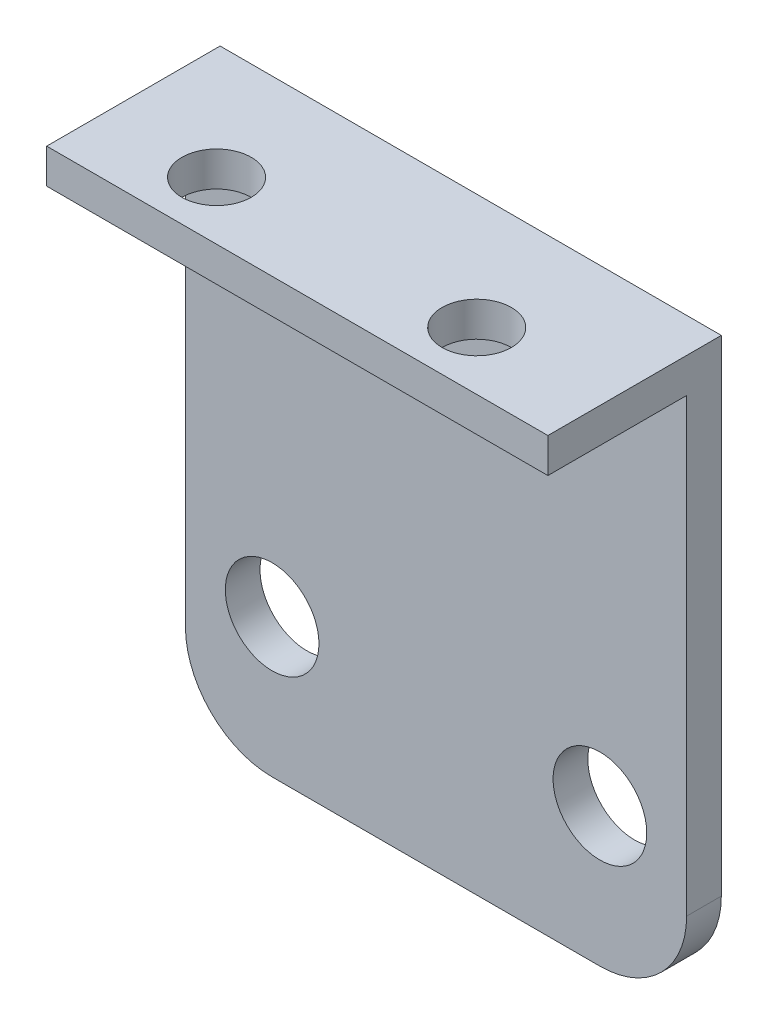
ISO-10303-21;
HEADER;
FILE_DESCRIPTION(('STEP AP214'),'2;1');
FILE_NAME('part.step','',(''),(''),'','','');
FILE_SCHEMA(('AUTOMOTIVE_DESIGN { 1 0 10303 214 1 1 1 1 }'));
ENDSEC;
DATA;
#1=APPLICATION_CONTEXT('core data for automotive mechanical design processes');
#2=APPLICATION_PROTOCOL_DEFINITION('international standard','automotive_design',2000,#1);
#3=PRODUCT_CONTEXT('',#1,'mechanical');
#4=PRODUCT('Part','Part','',(#3));
#5=PRODUCT_RELATED_PRODUCT_CATEGORY('part','',(#4));
#6=PRODUCT_DEFINITION_FORMATION('','',#4);
#7=PRODUCT_DEFINITION_CONTEXT('part definition',#1,'design');
#8=PRODUCT_DEFINITION('design','',#6,#7);
#9=PRODUCT_DEFINITION_SHAPE('','',#8);
#10=(LENGTH_UNIT() NAMED_UNIT(*) SI_UNIT(.MILLI.,.METRE.));
#11=(NAMED_UNIT(*) PLANE_ANGLE_UNIT() SI_UNIT($,.RADIAN.));
#12=(NAMED_UNIT(*) SI_UNIT($,.STERADIAN.) SOLID_ANGLE_UNIT());
#13=UNCERTAINTY_MEASURE_WITH_UNIT(LENGTH_MEASURE(1.E-05),#10,'distance_accuracy_value','');
#14=(GEOMETRIC_REPRESENTATION_CONTEXT(3) GLOBAL_UNCERTAINTY_ASSIGNED_CONTEXT((#13)) GLOBAL_UNIT_ASSIGNED_CONTEXT((#10,
#11,#12)) REPRESENTATION_CONTEXT('',''));
#15=CARTESIAN_POINT('',(0.,0.,0.));
#16=DIRECTION('',(0.,0.,1.));
#17=DIRECTION('',(1.,0.,0.));
#18=AXIS2_PLACEMENT_3D('',#15,#16,#17);
#19=CARTESIAN_POINT('',(0.,0.,2.));
#20=DIRECTION('',(0.,0.,-1.));
#21=DIRECTION('',(-1.,0.,0.));
#22=AXIS2_PLACEMENT_3D('',#19,#20,#21);
#23=PLANE('',#22);
#24=CARTESIAN_POINT('',(10.3547402338222,49.5925449565304,2.));
#25=DIRECTION('',(0.,0.,1.));
#26=DIRECTION('',(1.,0.,0.));
#27=AXIS2_PLACEMENT_3D('',#24,#25,#26);
#28=CIRCLE('',#27,2.7);
#29=CARTESIAN_POINT('',(13.0547402338222,49.5925449565304,2.));
#30=VERTEX_POINT('',#29);
#31=EDGE_CURVE('E132',#30,#30,#28,.T.);
#32=ORIENTED_EDGE('',*,*,#31,.F.);
#33=EDGE_LOOP('',(#32));
#34=FACE_BOUND('',#33,.T.);
#35=CARTESIAN_POINT('',(-8.5452597661767,49.5925449565311,2.));
#36=DIRECTION('',(0.,0.,1.));
#37=DIRECTION('',(1.,0.,0.));
#38=AXIS2_PLACEMENT_3D('',#35,#36,#37);
#39=CIRCLE('',#38,2.7);
#40=CARTESIAN_POINT('',(-5.84525976617669,49.5925449565311,2.));
#41=VERTEX_POINT('',#40);
#42=EDGE_CURVE('E140',#41,#41,#39,.T.);
#43=ORIENTED_EDGE('',*,*,#42,.F.);
#44=EDGE_LOOP('',(#43));
#45=FACE_BOUND('',#44,.T.);
#46=DIRECTION('',(1.,0.,0.));
#47=VECTOR('',#46,1.);
#48=CARTESIAN_POINT('',(-13.5452597661767,72.5925449565304,2.));
#49=LINE('',#48,#47);
#50=CARTESIAN_POINT('',(-13.5452597661767,72.5925449565304,2.));
#51=VERTEX_POINT('',#50);
#52=CARTESIAN_POINT('',(15.3547402338222,72.5925449565304,2.));
#53=VERTEX_POINT('',#52);
#54=EDGE_CURVE('E54',#51,#53,#49,.T.);
#55=ORIENTED_EDGE('',*,*,#54,.F.);
#56=DIRECTION('',(0.,-1.,0.));
#57=VECTOR('',#56,1.);
#58=CARTESIAN_POINT('',(-13.5452597661767,41.5925449565311,2.));
#59=LINE('',#58,#57);
#60=CARTESIAN_POINT('',(-13.5452597661767,46.5925449565311,2.));
#61=VERTEX_POINT('',#60);
#62=EDGE_CURVE('E128',#51,#61,#59,.T.);
#63=ORIENTED_EDGE('',*,*,#62,.T.);
#64=CARTESIAN_POINT('',(-8.5452597661767,46.5925449565311,2.));
#65=DIRECTION('',(0.,0.,-1.));
#66=DIRECTION('',(-1.,0.,0.));
#67=AXIS2_PLACEMENT_3D('',#64,#65,#66);
#68=CIRCLE('',#67,5.);
#69=CARTESIAN_POINT('',(-8.5452597661767,41.5925449565311,2.));
#70=VERTEX_POINT('',#69);
#71=EDGE_CURVE('E46',#61,#70,#68,.F.);
#72=ORIENTED_EDGE('',*,*,#71,.T.);
#73=DIRECTION('',(1.,0.,0.));
#74=VECTOR('',#73,1.);
#75=CARTESIAN_POINT('',(-13.5452597661767,41.5925449565311,2.));
#76=LINE('',#75,#74);
#77=CARTESIAN_POINT('',(10.3547402338222,41.5925449565311,2.));
#78=VERTEX_POINT('',#77);
#79=EDGE_CURVE('E147',#70,#78,#76,.T.);
#80=ORIENTED_EDGE('',*,*,#79,.T.);
#81=CARTESIAN_POINT('',(10.3547402338222,46.5925449565311,2.));
#82=DIRECTION('',(0.,0.,-1.));
#83=DIRECTION('',(-1.,0.,0.));
#84=AXIS2_PLACEMENT_3D('',#81,#82,#83);
#85=CIRCLE('',#84,5.);
#86=CARTESIAN_POINT('',(15.3547402338222,46.5925449565311,2.));
#87=VERTEX_POINT('',#86);
#88=EDGE_CURVE('E60',#78,#87,#85,.F.);
#89=ORIENTED_EDGE('',*,*,#88,.T.);
#90=DIRECTION('',(0.,1.,0.));
#91=VECTOR('',#90,1.);
#92=CARTESIAN_POINT('',(15.3547402338222,41.5925449565311,2.));
#93=LINE('',#92,#91);
#94=EDGE_CURVE('E150',#87,#53,#93,.T.);
#95=ORIENTED_EDGE('',*,*,#94,.T.);
#96=EDGE_LOOP('',(#55,#63,#72,#80,#89,#95));
#97=FACE_BOUND('',#96,.T.);
#98=ADVANCED_FACE('F37',(#34,#45,#97),#23,.F.);
#99=CARTESIAN_POINT('',(0.,0.,0.));
#100=DIRECTION('',(0.,0.,-1.));
#101=DIRECTION('',(-1.,0.,0.));
#102=AXIS2_PLACEMENT_3D('',#99,#100,#101);
#103=PLANE('',#102);
#104=CARTESIAN_POINT('',(-8.5452597661767,49.5925449565311,0.));
#105=DIRECTION('',(0.,0.,1.));
#106=DIRECTION('',(1.,0.,0.));
#107=AXIS2_PLACEMENT_3D('',#104,#105,#106);
#108=CIRCLE('',#107,2.7);
#109=CARTESIAN_POINT('',(-5.84525976617669,49.5925449565311,0.));
#110=VERTEX_POINT('',#109);
#111=EDGE_CURVE('E138',#110,#110,#108,.T.);
#112=ORIENTED_EDGE('',*,*,#111,.T.);
#113=EDGE_LOOP('',(#112));
#114=FACE_BOUND('',#113,.T.);
#115=DIRECTION('',(1.,0.,0.));
#116=VECTOR('',#115,1.);
#117=CARTESIAN_POINT('',(-13.5452597661767,41.5925449565311,0.));
#118=LINE('',#117,#116);
#119=CARTESIAN_POINT('',(-8.5452597661767,41.5925449565311,0.));
#120=VERTEX_POINT('',#119);
#121=CARTESIAN_POINT('',(10.3547402338222,41.5925449565311,0.));
#122=VERTEX_POINT('',#121);
#123=EDGE_CURVE('E154',#120,#122,#118,.T.);
#124=ORIENTED_EDGE('',*,*,#123,.F.);
#125=CARTESIAN_POINT('',(-8.5452597661767,46.5925449565311,0.));
#126=DIRECTION('',(0.,0.,-1.));
#127=DIRECTION('',(-1.,0.,0.));
#128=AXIS2_PLACEMENT_3D('',#125,#126,#127);
#129=CIRCLE('',#128,5.);
#130=CARTESIAN_POINT('',(-13.5452597661767,46.5925449565311,0.));
#131=VERTEX_POINT('',#130);
#132=EDGE_CURVE('E171',#120,#131,#129,.T.);
#133=ORIENTED_EDGE('',*,*,#132,.T.);
#134=DIRECTION('',(0.,-1.,0.));
#135=VECTOR('',#134,1.);
#136=CARTESIAN_POINT('',(-13.5452597661767,41.5925449565311,0.));
#137=LINE('',#136,#135);
#138=CARTESIAN_POINT('',(-13.5452597661767,74.5925449565304,0.));
#139=VERTEX_POINT('',#138);
#140=EDGE_CURVE('E143',#139,#131,#137,.T.);
#141=ORIENTED_EDGE('',*,*,#140,.F.);
#142=DIRECTION('',(-1.,0.,0.));
#143=VECTOR('',#142,1.);
#144=CARTESIAN_POINT('',(-13.5452597661767,74.5925449565304,0.));
#145=LINE('',#144,#143);
#146=CARTESIAN_POINT('',(15.3547402338222,74.5925449565304,0.));
#147=VERTEX_POINT('',#146);
#148=EDGE_CURVE('E148',#147,#139,#145,.T.);
#149=ORIENTED_EDGE('',*,*,#148,.F.);
#150=DIRECTION('',(0.,1.,0.));
#151=VECTOR('',#150,1.);
#152=CARTESIAN_POINT('',(15.3547402338222,41.5925449565311,0.));
#153=LINE('',#152,#151);
#154=CARTESIAN_POINT('',(15.3547402338222,46.5925449565311,0.));
#155=VERTEX_POINT('',#154);
#156=EDGE_CURVE('E157',#155,#147,#153,.T.);
#157=ORIENTED_EDGE('',*,*,#156,.F.);
#158=CARTESIAN_POINT('',(10.3547402338222,46.5925449565311,0.));
#159=DIRECTION('',(0.,0.,-1.));
#160=DIRECTION('',(-1.,0.,0.));
#161=AXIS2_PLACEMENT_3D('',#158,#159,#160);
#162=CIRCLE('',#161,5.);
#163=EDGE_CURVE('E169',#155,#122,#162,.T.);
#164=ORIENTED_EDGE('',*,*,#163,.T.);
#165=EDGE_LOOP('',(#124,#133,#141,#149,#157,#164));
#166=FACE_BOUND('',#165,.T.);
#167=CARTESIAN_POINT('',(10.3547402338222,49.5925449565304,0.));
#168=DIRECTION('',(0.,0.,1.));
#169=DIRECTION('',(1.,0.,0.));
#170=AXIS2_PLACEMENT_3D('',#167,#168,#169);
#171=CIRCLE('',#170,2.7);
#172=CARTESIAN_POINT('',(13.0547402338222,49.5925449565304,0.));
#173=VERTEX_POINT('',#172);
#174=EDGE_CURVE('E129',#173,#173,#171,.T.);
#175=ORIENTED_EDGE('',*,*,#174,.T.);
#176=EDGE_LOOP('',(#175));
#177=FACE_BOUND('',#176,.T.);
#178=ADVANCED_FACE('F201',(#114,#166,#177),#103,.T.);
#179=CARTESIAN_POINT('',(-13.5452597661767,41.5925449565311,2.));
#180=DIRECTION('',(1.,0.,0.));
#181=DIRECTION('',(0.,0.,-1.));
#182=AXIS2_PLACEMENT_3D('',#179,#180,#181);
#183=PLANE('',#182);
#184=ORIENTED_EDGE('',*,*,#140,.T.);
#185=DIRECTION('',(0.,0.,-1.));
#186=VECTOR('',#185,1.);
#187=CARTESIAN_POINT('',(-13.5452597661767,46.5925449565311,2.));
#188=LINE('',#187,#186);
#189=EDGE_CURVE('E173',#131,#61,#188,.F.);
#190=ORIENTED_EDGE('',*,*,#189,.T.);
#191=ORIENTED_EDGE('',*,*,#62,.F.);
#192=DIRECTION('',(0.,0.,-1.));
#193=VECTOR('',#192,1.);
#194=CARTESIAN_POINT('',(-13.5452597661767,72.5925449565304,10.));
#195=LINE('',#194,#193);
#196=CARTESIAN_POINT('',(-13.5452597661767,72.5925449565304,10.));
#197=VERTEX_POINT('',#196);
#198=EDGE_CURVE('E108',#197,#51,#195,.T.);
#199=ORIENTED_EDGE('',*,*,#198,.F.);
#200=DIRECTION('',(0.,-1.,0.));
#201=VECTOR('',#200,1.);
#202=CARTESIAN_POINT('',(-13.5452597661767,74.5925449565304,10.));
#203=LINE('',#202,#201);
#204=CARTESIAN_POINT('',(-13.5452597661767,74.5925449565304,10.));
#205=VERTEX_POINT('',#204);
#206=EDGE_CURVE('E115',#205,#197,#203,.T.);
#207=ORIENTED_EDGE('',*,*,#206,.F.);
#208=DIRECTION('',(0.,0.,-1.));
#209=VECTOR('',#208,1.);
#210=CARTESIAN_POINT('',(-13.5452597661767,74.5925449565304,2.));
#211=LINE('',#210,#209);
#212=EDGE_CURVE('E152',#205,#139,#211,.T.);
#213=ORIENTED_EDGE('',*,*,#212,.T.);
#214=EDGE_LOOP('',(#184,#190,#191,#199,#207,#213));
#215=FACE_BOUND('',#214,.T.);
#216=ADVANCED_FACE('F126',(#215),#183,.F.);
#217=CARTESIAN_POINT('',(-13.5452597661767,41.5925449565311,2.));
#218=DIRECTION('',(0.,1.,0.));
#219=DIRECTION('',(0.,0.,1.));
#220=AXIS2_PLACEMENT_3D('',#217,#218,#219);
#221=PLANE('',#220);
#222=ORIENTED_EDGE('',*,*,#79,.F.);
#223=DIRECTION('',(0.,0.,-1.));
#224=VECTOR('',#223,1.);
#225=CARTESIAN_POINT('',(-8.5452597661767,41.5925449565311,2.));
#226=LINE('',#225,#224);
#227=EDGE_CURVE('E166',#70,#120,#226,.T.);
#228=ORIENTED_EDGE('',*,*,#227,.T.);
#229=ORIENTED_EDGE('',*,*,#123,.T.);
#230=DIRECTION('',(0.,0.,-1.));
#231=VECTOR('',#230,1.);
#232=CARTESIAN_POINT('',(10.3547402338222,41.5925449565311,2.));
#233=LINE('',#232,#231);
#234=EDGE_CURVE('E164',#122,#78,#233,.F.);
#235=ORIENTED_EDGE('',*,*,#234,.T.);
#236=EDGE_LOOP('',(#222,#228,#229,#235));
#237=FACE_BOUND('',#236,.T.);
#238=ADVANCED_FACE('F210',(#237),#221,.F.);
#239=CARTESIAN_POINT('',(15.3547402338222,41.5925449565311,2.));
#240=DIRECTION('',(-1.,0.,0.));
#241=DIRECTION('',(0.,0.,1.));
#242=AXIS2_PLACEMENT_3D('',#239,#240,#241);
#243=PLANE('',#242);
#244=ORIENTED_EDGE('',*,*,#94,.F.);
#245=DIRECTION('',(0.,0.,-1.));
#246=VECTOR('',#245,1.);
#247=CARTESIAN_POINT('',(15.3547402338222,46.5925449565311,2.));
#248=LINE('',#247,#246);
#249=EDGE_CURVE('E11',#87,#155,#248,.T.);
#250=ORIENTED_EDGE('',*,*,#249,.T.);
#251=ORIENTED_EDGE('',*,*,#156,.T.);
#252=DIRECTION('',(0.,0.,-1.));
#253=VECTOR('',#252,1.);
#254=CARTESIAN_POINT('',(15.3547402338222,74.5925449565304,2.));
#255=LINE('',#254,#253);
#256=CARTESIAN_POINT('',(15.3547402338222,74.5925449565304,10.));
#257=VERTEX_POINT('',#256);
#258=EDGE_CURVE('E161',#257,#147,#255,.T.);
#259=ORIENTED_EDGE('',*,*,#258,.F.);
#260=DIRECTION('',(0.,1.,0.));
#261=VECTOR('',#260,1.);
#262=CARTESIAN_POINT('',(15.3547402338222,74.5925449565304,10.));
#263=LINE('',#262,#261);
#264=CARTESIAN_POINT('',(15.3547402338222,72.5925449565304,10.));
#265=VERTEX_POINT('',#264);
#266=EDGE_CURVE('E114',#265,#257,#263,.T.);
#267=ORIENTED_EDGE('',*,*,#266,.F.);
#268=DIRECTION('',(0.,0.,-1.));
#269=VECTOR('',#268,1.);
#270=CARTESIAN_POINT('',(15.3547402338222,72.5925449565304,10.));
#271=LINE('',#270,#269);
#272=EDGE_CURVE('E110',#265,#53,#271,.T.);
#273=ORIENTED_EDGE('',*,*,#272,.T.);
#274=EDGE_LOOP('',(#244,#250,#251,#259,#267,#273));
#275=FACE_BOUND('',#274,.T.);
#276=ADVANCED_FACE('F192',(#275),#243,.F.);
#277=CARTESIAN_POINT('',(-13.5452597661767,74.5925449565304,2.));
#278=DIRECTION('',(0.,-1.,0.));
#279=DIRECTION('',(0.,0.,-1.));
#280=AXIS2_PLACEMENT_3D('',#277,#278,#279);
#281=PLANE('',#280);
#282=CARTESIAN_POINT('',(-7.09161571368536,74.5925449565304,6.65819594732667));
#283=DIRECTION('',(0.,1.,0.));
#284=DIRECTION('',(0.,0.,1.));
#285=AXIS2_PLACEMENT_3D('',#282,#283,#284);
#286=CIRCLE('',#285,2.00000000000001);
#287=CARTESIAN_POINT('',(-7.09161571368536,74.5925449565304,8.65819594732667));
#288=VERTEX_POINT('',#287);
#289=EDGE_CURVE('E178',#288,#288,#286,.T.);
#290=ORIENTED_EDGE('',*,*,#289,.F.);
#291=EDGE_LOOP('',(#290));
#292=FACE_BOUND('',#291,.T.);
#293=CARTESIAN_POINT('',(7.90838428631458,74.5925449565304,6.65819594732661));
#294=DIRECTION('',(0.,1.,0.));
#295=DIRECTION('',(0.,0.,1.));
#296=AXIS2_PLACEMENT_3D('',#293,#294,#295);
#297=CIRCLE('',#296,2.);
#298=CARTESIAN_POINT('',(7.90838428631458,74.5925449565304,8.65819594732661));
#299=VERTEX_POINT('',#298);
#300=EDGE_CURVE('E183',#299,#299,#297,.T.);
#301=ORIENTED_EDGE('',*,*,#300,.F.);
#302=EDGE_LOOP('',(#301));
#303=FACE_BOUND('',#302,.T.);
#304=ORIENTED_EDGE('',*,*,#148,.T.);
#305=ORIENTED_EDGE('',*,*,#212,.F.);
#306=DIRECTION('',(-1.,0.,0.));
#307=VECTOR('',#306,1.);
#308=CARTESIAN_POINT('',(-13.5452597661767,74.5925449565304,10.));
#309=LINE('',#308,#307);
#310=EDGE_CURVE('E121',#257,#205,#309,.T.);
#311=ORIENTED_EDGE('',*,*,#310,.F.);
#312=ORIENTED_EDGE('',*,*,#258,.T.);
#313=EDGE_LOOP('',(#304,#305,#311,#312));
#314=FACE_BOUND('',#313,.T.);
#315=ADVANCED_FACE('F195',(#292,#303,#314),#281,.F.);
#316=CARTESIAN_POINT('',(-8.5452597661767,49.5925449565311,2.));
#317=DIRECTION('',(0.,0.,-1.));
#318=DIRECTION('',(-1.,0.,0.));
#319=AXIS2_PLACEMENT_3D('',#316,#317,#318);
#320=CYLINDRICAL_SURFACE('',#319,2.7);
#321=ORIENTED_EDGE('',*,*,#42,.T.);
#322=EDGE_LOOP('',(#321));
#323=FACE_BOUND('',#322,.T.);
#324=ORIENTED_EDGE('',*,*,#111,.F.);
#325=EDGE_LOOP('',(#324));
#326=FACE_BOUND('',#325,.T.);
#327=ADVANCED_FACE('F232',(#323,#326),#320,.F.);
#328=CARTESIAN_POINT('',(10.3547402338222,49.5925449565304,2.));
#329=DIRECTION('',(0.,0.,-1.));
#330=DIRECTION('',(-1.,0.,0.));
#331=AXIS2_PLACEMENT_3D('',#328,#329,#330);
#332=CYLINDRICAL_SURFACE('',#331,2.7);
#333=ORIENTED_EDGE('',*,*,#31,.T.);
#334=EDGE_LOOP('',(#333));
#335=FACE_BOUND('',#334,.T.);
#336=ORIENTED_EDGE('',*,*,#174,.F.);
#337=EDGE_LOOP('',(#336));
#338=FACE_BOUND('',#337,.T.);
#339=ADVANCED_FACE('F220',(#335,#338),#332,.F.);
#340=CARTESIAN_POINT('',(-8.5452597661767,46.5925449565311,2.));
#341=DIRECTION('',(0.,0.,-1.));
#342=DIRECTION('',(-1.,0.,0.));
#343=AXIS2_PLACEMENT_3D('',#340,#341,#342);
#344=CYLINDRICAL_SURFACE('',#343,5.);
#345=ORIENTED_EDGE('',*,*,#71,.F.);
#346=ORIENTED_EDGE('',*,*,#189,.F.);
#347=ORIENTED_EDGE('',*,*,#132,.F.);
#348=ORIENTED_EDGE('',*,*,#227,.F.);
#349=EDGE_LOOP('',(#345,#346,#347,#348));
#350=FACE_BOUND('',#349,.T.);
#351=ADVANCED_FACE('F207',(#350),#344,.T.);
#352=CARTESIAN_POINT('',(10.3547402338222,46.5925449565311,2.));
#353=DIRECTION('',(0.,0.,-1.));
#354=DIRECTION('',(-1.,0.,0.));
#355=AXIS2_PLACEMENT_3D('',#352,#353,#354);
#356=CYLINDRICAL_SURFACE('',#355,5.);
#357=ORIENTED_EDGE('',*,*,#88,.F.);
#358=ORIENTED_EDGE('',*,*,#234,.F.);
#359=ORIENTED_EDGE('',*,*,#163,.F.);
#360=ORIENTED_EDGE('',*,*,#249,.F.);
#361=EDGE_LOOP('',(#357,#358,#359,#360));
#362=FACE_BOUND('',#361,.T.);
#363=ADVANCED_FACE('F39',(#362),#356,.T.);
#364=CARTESIAN_POINT('',(-13.5452597661767,72.5925449565304,10.));
#365=DIRECTION('',(0.,1.,0.));
#366=DIRECTION('',(0.,0.,1.));
#367=AXIS2_PLACEMENT_3D('',#364,#365,#366);
#368=PLANE('',#367);
#369=CARTESIAN_POINT('',(-7.09161571368536,72.5925449565304,6.65819594732667));
#370=DIRECTION('',(0.,1.,0.));
#371=DIRECTION('',(0.,0.,1.));
#372=AXIS2_PLACEMENT_3D('',#369,#370,#371);
#373=CIRCLE('',#372,2.00000000000001);
#374=CARTESIAN_POINT('',(-7.09161571368536,72.5925449565304,8.65819594732667));
#375=VERTEX_POINT('',#374);
#376=EDGE_CURVE('E41',#375,#375,#373,.T.);
#377=ORIENTED_EDGE('',*,*,#376,.T.);
#378=EDGE_LOOP('',(#377));
#379=FACE_BOUND('',#378,.T.);
#380=CARTESIAN_POINT('',(7.90838428631458,72.5925449565304,6.65819594732661));
#381=DIRECTION('',(0.,1.,0.));
#382=DIRECTION('',(0.,0.,1.));
#383=AXIS2_PLACEMENT_3D('',#380,#381,#382);
#384=CIRCLE('',#383,2.);
#385=CARTESIAN_POINT('',(7.90838428631458,72.5925449565304,8.65819594732661));
#386=VERTEX_POINT('',#385);
#387=EDGE_CURVE('E176',#386,#386,#384,.T.);
#388=ORIENTED_EDGE('',*,*,#387,.T.);
#389=EDGE_LOOP('',(#388));
#390=FACE_BOUND('',#389,.T.);
#391=ORIENTED_EDGE('',*,*,#54,.T.);
#392=ORIENTED_EDGE('',*,*,#272,.F.);
#393=DIRECTION('',(1.,0.,0.));
#394=VECTOR('',#393,1.);
#395=CARTESIAN_POINT('',(-13.5452597661767,72.5925449565304,10.));
#396=LINE('',#395,#394);
#397=EDGE_CURVE('E104',#197,#265,#396,.T.);
#398=ORIENTED_EDGE('',*,*,#397,.F.);
#399=ORIENTED_EDGE('',*,*,#198,.T.);
#400=EDGE_LOOP('',(#391,#392,#398,#399));
#401=FACE_BOUND('',#400,.T.);
#402=ADVANCED_FACE('F106',(#379,#390,#401),#368,.F.);
#403=CARTESIAN_POINT('',(0.,0.,10.));
#404=DIRECTION('',(0.,0.,1.));
#405=DIRECTION('',(1.,0.,0.));
#406=AXIS2_PLACEMENT_3D('',#403,#404,#405);
#407=PLANE('',#406);
#408=ORIENTED_EDGE('',*,*,#206,.T.);
#409=ORIENTED_EDGE('',*,*,#397,.T.);
#410=ORIENTED_EDGE('',*,*,#266,.T.);
#411=ORIENTED_EDGE('',*,*,#310,.T.);
#412=EDGE_LOOP('',(#408,#409,#410,#411));
#413=FACE_BOUND('',#412,.T.);
#414=ADVANCED_FACE('F119',(#413),#407,.T.);
#415=CARTESIAN_POINT('',(7.90838428631458,64.5925449565304,6.65819594732661));
#416=DIRECTION('',(0.,1.,0.));
#417=DIRECTION('',(0.,0.,1.));
#418=AXIS2_PLACEMENT_3D('',#415,#416,#417);
#419=CYLINDRICAL_SURFACE('',#418,2.);
#420=ORIENTED_EDGE('',*,*,#300,.T.);
#421=EDGE_LOOP('',(#420));
#422=FACE_BOUND('',#421,.T.);
#423=ORIENTED_EDGE('',*,*,#387,.F.);
#424=EDGE_LOOP('',(#423));
#425=FACE_BOUND('',#424,.T.);
#426=ADVANCED_FACE('F304',(#422,#425),#419,.F.);
#427=CARTESIAN_POINT('',(-7.09161571368536,64.5925449565304,6.65819594732667));
#428=DIRECTION('',(0.,1.,0.));
#429=DIRECTION('',(0.,0.,1.));
#430=AXIS2_PLACEMENT_3D('',#427,#428,#429);
#431=CYLINDRICAL_SURFACE('',#430,2.00000000000001);
#432=ORIENTED_EDGE('',*,*,#289,.T.);
#433=EDGE_LOOP('',(#432));
#434=FACE_BOUND('',#433,.T.);
#435=ORIENTED_EDGE('',*,*,#376,.F.);
#436=EDGE_LOOP('',(#435));
#437=FACE_BOUND('',#436,.T.);
#438=ADVANCED_FACE('F312',(#434,#437),#431,.F.);
#439=CLOSED_SHELL('',(#98,#178,#216,#238,#276,#315,#327,#339,#351,#363,#402,#414,#426,#438));
#440=MANIFOLD_SOLID_BREP('B2',#439);
#441=ADVANCED_BREP_SHAPE_REPRESENTATION('',(#18,#440),#14);
#442=SHAPE_DEFINITION_REPRESENTATION(#9,#441);
ENDSEC;
END-ISO-10303-21;
